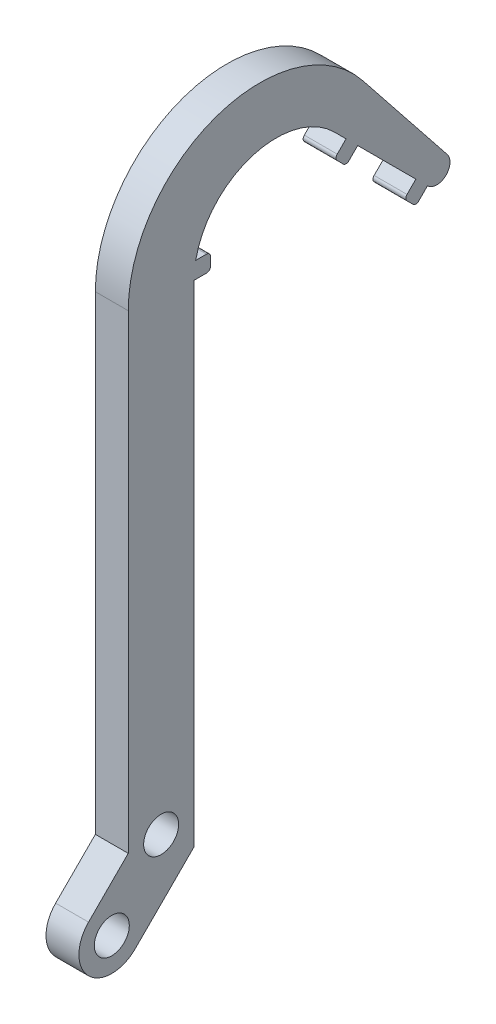
ISO-10303-21;
HEADER;
FILE_DESCRIPTION(('STEP AP214'),'2;1');
FILE_NAME('part.step','',(''),(''),'','','');
FILE_SCHEMA(('AUTOMOTIVE_DESIGN { 1 0 10303 214 1 1 1 1 }'));
ENDSEC;
DATA;
#1=APPLICATION_CONTEXT('core data for automotive mechanical design processes');
#2=APPLICATION_PROTOCOL_DEFINITION('international standard','automotive_design',2000,#1);
#3=PRODUCT_CONTEXT('',#1,'mechanical');
#4=PRODUCT('Part','Part','',(#3));
#5=PRODUCT_RELATED_PRODUCT_CATEGORY('part','',(#4));
#6=PRODUCT_DEFINITION_FORMATION('','',#4);
#7=PRODUCT_DEFINITION_CONTEXT('part definition',#1,'design');
#8=PRODUCT_DEFINITION('design','',#6,#7);
#9=PRODUCT_DEFINITION_SHAPE('','',#8);
#10=(LENGTH_UNIT() NAMED_UNIT(*) SI_UNIT(.MILLI.,.METRE.));
#11=(NAMED_UNIT(*) PLANE_ANGLE_UNIT() SI_UNIT($,.RADIAN.));
#12=(NAMED_UNIT(*) SI_UNIT($,.STERADIAN.) SOLID_ANGLE_UNIT());
#13=UNCERTAINTY_MEASURE_WITH_UNIT(LENGTH_MEASURE(1.E-05),#10,'distance_accuracy_value','');
#14=(GEOMETRIC_REPRESENTATION_CONTEXT(3) GLOBAL_UNCERTAINTY_ASSIGNED_CONTEXT((#13)) GLOBAL_UNIT_ASSIGNED_CONTEXT((#10,
#11,#12)) REPRESENTATION_CONTEXT('',''));
#15=CARTESIAN_POINT('',(0.,0.,0.));
#16=DIRECTION('',(0.,0.,1.));
#17=DIRECTION('',(1.,0.,0.));
#18=AXIS2_PLACEMENT_3D('',#15,#16,#17);
#19=CARTESIAN_POINT('',(6.35,-6.73519209080201,-29.1858323934747));
#20=DIRECTION('',(0.,0.707106781186544,-0.707106781186551));
#21=DIRECTION('',(0.,0.707106781186551,0.707106781186544));
#22=AXIS2_PLACEMENT_3D('',#19,#20,#21);
#23=PLANE('',#22);
#24=DIRECTION('',(0.,-0.707106781186551,-0.707106781186544));
#25=VECTOR('',#24,1.);
#26=CARTESIAN_POINT('',(6.35,-6.73519209080201,-29.1858323934747));
#27=LINE('',#26,#25);
#28=CARTESIAN_POINT('',(6.35,6.73519209080179,-15.715448211871));
#29=VERTEX_POINT('',#28);
#30=CARTESIAN_POINT('',(6.35,-4.49012806053471,-26.9407683632074));
#31=VERTEX_POINT('',#30);
#32=EDGE_CURVE('E312',#29,#31,#27,.T.);
#33=ORIENTED_EDGE('',*,*,#32,.F.);
#34=DIRECTION('',(1.,0.,0.));
#35=VECTOR('',#34,1.);
#36=CARTESIAN_POINT('',(-6.34999999999994,6.7351920908018,-15.715448211871));
#37=LINE('',#36,#35);
#38=CARTESIAN_POINT('',(0.,6.7351920908018,-15.715448211871));
#39=VERTEX_POINT('',#38);
#40=EDGE_CURVE('E254',#39,#29,#37,.T.);
#41=ORIENTED_EDGE('',*,*,#40,.F.);
#42=DIRECTION('',(0.,-0.707106781186551,-0.707106781186544));
#43=VECTOR('',#42,1.);
#44=CARTESIAN_POINT('',(0.,-6.73519209080201,-29.1858323934747));
#45=LINE('',#44,#43);
#46=CARTESIAN_POINT('',(0.,-4.49012806053471,-26.9407683632074));
#47=VERTEX_POINT('',#46);
#48=EDGE_CURVE('E222',#39,#47,#45,.T.);
#49=ORIENTED_EDGE('',*,*,#48,.T.);
#50=DIRECTION('',(1.,0.,0.));
#51=VECTOR('',#50,1.);
#52=CARTESIAN_POINT('',(-6.34999999999994,-4.49012806053463,-26.9407683632075));
#53=LINE('',#52,#51);
#54=EDGE_CURVE('E275',#47,#31,#53,.T.);
#55=ORIENTED_EDGE('',*,*,#54,.T.);
#56=EDGE_LOOP('',(#33,#41,#49,#55));
#57=FACE_BOUND('',#56,.T.);
#58=ADVANCED_FACE('F36',(#57),#23,.F.);
#59=CARTESIAN_POINT('',(6.35,-97.1098719394654,36.2401280605346));
#60=DIRECTION('',(0.,-0.707106781186547,-0.707106781186548));
#61=DIRECTION('',(0.,0.707106781186548,-0.707106781186547));
#62=AXIS2_PLACEMENT_3D('',#59,#60,#61);
#63=PLANE('',#62);
#64=DIRECTION('',(0.,-0.707106781186548,0.707106781186547));
#65=VECTOR('',#64,1.);
#66=CARTESIAN_POINT('',(0.,-97.1098719394654,36.2401280605346));
#67=LINE('',#66,#65);
#68=CARTESIAN_POINT('',(0.,-89.4447438789309,28.575));
#69=VERTEX_POINT('',#68);
#70=CARTESIAN_POINT('',(0.,-97.1098719394654,36.2401280605346));
#71=VERTEX_POINT('',#70);
#72=EDGE_CURVE('E300',#69,#71,#67,.T.);
#73=ORIENTED_EDGE('',*,*,#72,.T.);
#74=DIRECTION('',(-1.,0.,0.));
#75=VECTOR('',#74,1.);
#76=CARTESIAN_POINT('',(6.35,-97.1098719394654,36.2401280605346));
#77=LINE('',#76,#75);
#78=CARTESIAN_POINT('',(6.35,-97.1098719394654,36.2401280605346));
#79=VERTEX_POINT('',#78);
#80=EDGE_CURVE('E366',#79,#71,#77,.T.);
#81=ORIENTED_EDGE('',*,*,#80,.F.);
#82=DIRECTION('',(0.,-0.707106781186548,0.707106781186547));
#83=VECTOR('',#82,1.);
#84=CARTESIAN_POINT('',(6.35,-97.1098719394654,36.2401280605346));
#85=LINE('',#84,#83);
#86=CARTESIAN_POINT('',(6.35,-89.4447438789309,28.575));
#87=VERTEX_POINT('',#86);
#88=EDGE_CURVE('E301',#87,#79,#85,.T.);
#89=ORIENTED_EDGE('',*,*,#88,.F.);
#90=DIRECTION('',(-1.,0.,0.));
#91=VECTOR('',#90,1.);
#92=CARTESIAN_POINT('',(6.35,-89.4447438789309,28.575));
#93=LINE('',#92,#91);
#94=EDGE_CURVE('E324',#87,#69,#93,.T.);
#95=ORIENTED_EDGE('',*,*,#94,.T.);
#96=EDGE_LOOP('',(#73,#81,#89,#95));
#97=FACE_BOUND('',#96,.T.);
#98=ADVANCED_FACE('F450',(#97),#63,.F.);
#99=CARTESIAN_POINT('',(6.35,-101.6,31.75));
#100=DIRECTION('',(-1.,0.,0.));
#101=DIRECTION('',(0.,0.,1.));
#102=AXIS2_PLACEMENT_3D('',#99,#100,#101);
#103=CYLINDRICAL_SURFACE('',#102,6.34999999999997);
#104=CARTESIAN_POINT('',(0.,-101.6,31.75));
#105=DIRECTION('',(1.,0.,0.));
#106=DIRECTION('',(0.,0.,-1.));
#107=AXIS2_PLACEMENT_3D('',#104,#105,#106);
#108=CIRCLE('',#107,6.34999999999997);
#109=CARTESIAN_POINT('',(0.,-106.090128060535,27.2598719394654));
#110=VERTEX_POINT('',#109);
#111=EDGE_CURVE('E327',#71,#110,#108,.T.);
#112=ORIENTED_EDGE('',*,*,#111,.T.);
#113=DIRECTION('',(-1.,0.,0.));
#114=VECTOR('',#113,1.);
#115=CARTESIAN_POINT('',(6.35,-106.090128060535,27.2598719394654));
#116=LINE('',#115,#114);
#117=CARTESIAN_POINT('',(6.35,-106.090128060535,27.2598719394654));
#118=VERTEX_POINT('',#117);
#119=EDGE_CURVE('E363',#118,#110,#116,.T.);
#120=ORIENTED_EDGE('',*,*,#119,.F.);
#121=CARTESIAN_POINT('',(6.35,-101.6,31.75));
#122=DIRECTION('',(1.,0.,0.));
#123=DIRECTION('',(0.,0.,-1.));
#124=AXIS2_PLACEMENT_3D('',#121,#122,#123);
#125=CIRCLE('',#124,6.34999999999997);
#126=EDGE_CURVE('E304',#79,#118,#125,.T.);
#127=ORIENTED_EDGE('',*,*,#126,.F.);
#128=ORIENTED_EDGE('',*,*,#80,.T.);
#129=EDGE_LOOP('',(#112,#120,#127,#128));
#130=FACE_BOUND('',#129,.T.);
#131=ADVANCED_FACE('F446',(#130),#103,.T.);
#132=CARTESIAN_POINT('',(6.35,-94.7052561210691,15.875));
#133=DIRECTION('',(0.,0.707106781186549,0.707106781186546));
#134=DIRECTION('',(0.,-0.707106781186546,0.707106781186549));
#135=AXIS2_PLACEMENT_3D('',#132,#133,#134);
#136=PLANE('',#135);
#137=DIRECTION('',(0.,0.707106781186546,-0.707106781186549));
#138=VECTOR('',#137,1.);
#139=CARTESIAN_POINT('',(0.,-94.7052561210691,15.875));
#140=LINE('',#139,#138);
#141=CARTESIAN_POINT('',(0.,-94.7052561210691,15.875));
#142=VERTEX_POINT('',#141);
#143=EDGE_CURVE('E329',#110,#142,#140,.T.);
#144=ORIENTED_EDGE('',*,*,#143,.T.);
#145=DIRECTION('',(-1.,0.,0.));
#146=VECTOR('',#145,1.);
#147=CARTESIAN_POINT('',(6.35,-94.7052561210691,15.875));
#148=LINE('',#147,#146);
#149=CARTESIAN_POINT('',(6.35,-94.7052561210691,15.875));
#150=VERTEX_POINT('',#149);
#151=EDGE_CURVE('E360',#150,#142,#148,.T.);
#152=ORIENTED_EDGE('',*,*,#151,.F.);
#153=DIRECTION('',(0.,0.707106781186546,-0.707106781186549));
#154=VECTOR('',#153,1.);
#155=CARTESIAN_POINT('',(6.35,-94.7052561210691,15.875));
#156=LINE('',#155,#154);
#157=EDGE_CURVE('E307',#118,#150,#156,.T.);
#158=ORIENTED_EDGE('',*,*,#157,.F.);
#159=ORIENTED_EDGE('',*,*,#119,.T.);
#160=EDGE_LOOP('',(#144,#152,#158,#159));
#161=FACE_BOUND('',#160,.T.);
#162=ADVANCED_FACE('F443',(#161),#136,.F.);
#163=CARTESIAN_POINT('',(6.35,0.,15.875));
#164=DIRECTION('',(0.,0.,1.));
#165=DIRECTION('',(0.,-1.,0.));
#166=AXIS2_PLACEMENT_3D('',#163,#164,#165);
#167=PLANE('',#166);
#168=DIRECTION('',(0.,1.,0.));
#169=VECTOR('',#168,1.);
#170=CARTESIAN_POINT('',(0.,0.,15.875));
#171=LINE('',#170,#169);
#172=CARTESIAN_POINT('',(0.,0.,15.875));
#173=VERTEX_POINT('',#172);
#174=EDGE_CURVE('E223',#142,#173,#171,.T.);
#175=ORIENTED_EDGE('',*,*,#174,.T.);
#176=DIRECTION('',(-1.,0.,0.));
#177=VECTOR('',#176,1.);
#178=CARTESIAN_POINT('',(6.35,0.,15.875));
#179=LINE('',#178,#177);
#180=CARTESIAN_POINT('',(6.35,0.,15.875));
#181=VERTEX_POINT('',#180);
#182=EDGE_CURVE('E357',#181,#173,#179,.T.);
#183=ORIENTED_EDGE('',*,*,#182,.F.);
#184=DIRECTION('',(0.,1.,0.));
#185=VECTOR('',#184,1.);
#186=CARTESIAN_POINT('',(6.35,0.,15.875));
#187=LINE('',#186,#185);
#188=EDGE_CURVE('E309',#150,#181,#187,.T.);
#189=ORIENTED_EDGE('',*,*,#188,.F.);
#190=ORIENTED_EDGE('',*,*,#151,.T.);
#191=EDGE_LOOP('',(#175,#183,#189,#190));
#192=FACE_BOUND('',#191,.T.);
#193=ADVANCED_FACE('F438',(#192),#167,.F.);
#194=CARTESIAN_POINT('',(6.35,0.,0.));
#195=DIRECTION('',(-1.,0.,0.));
#196=DIRECTION('',(0.,0.,1.));
#197=AXIS2_PLACEMENT_3D('',#194,#195,#196);
#198=CYLINDRICAL_SURFACE('',#197,15.875);
#199=CARTESIAN_POINT('',(6.35,0.,0.));
#200=DIRECTION('',(-1.,0.,0.));
#201=DIRECTION('',(0.,0.,-1.));
#202=AXIS2_PLACEMENT_3D('',#199,#200,#201);
#203=CIRCLE('',#202,15.875);
#204=CARTESIAN_POINT('',(6.35,3.17499999999989,15.5542598666732));
#205=VERTEX_POINT('',#204);
#206=CARTESIAN_POINT('',(6.35,11.2253201513364,-11.2253201513365));
#207=VERTEX_POINT('',#206);
#208=EDGE_CURVE('E229',#205,#207,#203,.T.);
#209=ORIENTED_EDGE('',*,*,#208,.F.);
#210=DIRECTION('',(-1.,0.,0.));
#211=VECTOR('',#210,1.);
#212=CARTESIAN_POINT('',(6.35,3.17499999999989,15.5542598666732));
#213=LINE('',#212,#211);
#214=CARTESIAN_POINT('',(0.,3.17499999999989,15.5542598666732));
#215=VERTEX_POINT('',#214);
#216=EDGE_CURVE('E227',#205,#215,#213,.T.);
#217=ORIENTED_EDGE('',*,*,#216,.T.);
#218=CARTESIAN_POINT('',(0.,0.,0.));
#219=DIRECTION('',(-1.,0.,0.));
#220=DIRECTION('',(0.,0.,-1.));
#221=AXIS2_PLACEMENT_3D('',#218,#219,#220);
#222=CIRCLE('',#221,15.875);
#223=CARTESIAN_POINT('',(0.,11.2253201513364,-11.2253201513365));
#224=VERTEX_POINT('',#223);
#225=EDGE_CURVE('E209',#215,#224,#222,.T.);
#226=ORIENTED_EDGE('',*,*,#225,.T.);
#227=DIRECTION('',(-1.,0.,0.));
#228=VECTOR('',#227,1.);
#229=CARTESIAN_POINT('',(6.35,11.2253201513364,-11.2253201513365));
#230=LINE('',#229,#228);
#231=EDGE_CURVE('E355',#207,#224,#230,.T.);
#232=ORIENTED_EDGE('',*,*,#231,.F.);
#233=EDGE_LOOP('',(#209,#217,#226,#232));
#234=FACE_BOUND('',#233,.T.);
#235=ADVANCED_FACE('F228',(#234),#198,.F.);
#236=CARTESIAN_POINT('',(0.,8.98025612106909,-13.4703841816038));
#237=VERTEX_POINT('',#236);
#238=EDGE_CURVE('E218',#224,#237,#45,.T.);
#239=ORIENTED_EDGE('',*,*,#238,.T.);
#240=DIRECTION('',(1.,0.,0.));
#241=VECTOR('',#240,1.);
#242=CARTESIAN_POINT('',(-6.34999999999994,8.98025612106917,-13.4703841816038));
#243=LINE('',#242,#241);
#244=CARTESIAN_POINT('',(6.35,8.98025612106909,-13.4703841816038));
#245=VERTEX_POINT('',#244);
#246=EDGE_CURVE('E265',#237,#245,#243,.T.);
#247=ORIENTED_EDGE('',*,*,#246,.T.);
#248=EDGE_CURVE('E313',#207,#245,#27,.T.);
#249=ORIENTED_EDGE('',*,*,#248,.F.);
#250=ORIENTED_EDGE('',*,*,#231,.T.);
#251=EDGE_LOOP('',(#239,#247,#249,#250));
#252=FACE_BOUND('',#251,.T.);
#253=ADVANCED_FACE('F515',(#252),#23,.F.);
#254=CARTESIAN_POINT('',(6.35,-4.93914086658819,-30.9818836176886));
#255=DIRECTION('',(-1.,0.,0.));
#256=DIRECTION('',(0.,0.,1.));
#257=AXIS2_PLACEMENT_3D('',#254,#255,#256);
#258=CYLINDRICAL_SURFACE('',#257,2.54);
#259=CARTESIAN_POINT('',(0.,-4.93914086658819,-30.9818836176886));
#260=DIRECTION('',(1.,0.,0.));
#261=DIRECTION('',(0.,0.,-1.));
#262=AXIS2_PLACEMENT_3D('',#259,#260,#261);
#263=CIRCLE('',#262,2.54);
#264=CARTESIAN_POINT('',(0.,-6.73519209080201,-29.1858323934747));
#265=VERTEX_POINT('',#264);
#266=CARTESIAN_POINT('',(0.,-3.35748391332531,-32.969334568579));
#267=VERTEX_POINT('',#266);
#268=EDGE_CURVE('E334',#265,#267,#263,.T.);
#269=ORIENTED_EDGE('',*,*,#268,.T.);
#270=DIRECTION('',(-1.,0.,0.));
#271=VECTOR('',#270,1.);
#272=CARTESIAN_POINT('',(6.35,-3.35748391332531,-32.969334568579));
#273=LINE('',#272,#271);
#274=CARTESIAN_POINT('',(6.35,-3.35748391332531,-32.969334568579));
#275=VERTEX_POINT('',#274);
#276=EDGE_CURVE('E349',#275,#267,#273,.T.);
#277=ORIENTED_EDGE('',*,*,#276,.F.);
#278=CARTESIAN_POINT('',(6.35,-4.93914086658819,-30.9818836176886));
#279=DIRECTION('',(1.,0.,0.));
#280=DIRECTION('',(0.,0.,-1.));
#281=AXIS2_PLACEMENT_3D('',#278,#279,#280);
#282=CIRCLE('',#281,2.54);
#283=CARTESIAN_POINT('',(6.35,-6.73519209080201,-29.1858323934747));
#284=VERTEX_POINT('',#283);
#285=EDGE_CURVE('E316',#284,#275,#282,.T.);
#286=ORIENTED_EDGE('',*,*,#285,.F.);
#287=DIRECTION('',(-1.,0.,0.));
#288=VECTOR('',#287,1.);
#289=CARTESIAN_POINT('',(6.35,-6.73519209080201,-29.1858323934747));
#290=LINE('',#289,#288);
#291=EDGE_CURVE('E352',#284,#265,#290,.T.);
#292=ORIENTED_EDGE('',*,*,#291,.T.);
#293=EDGE_LOOP('',(#269,#277,#286,#292));
#294=FACE_BOUND('',#293,.T.);
#295=ADVANCED_FACE('F472',(#294),#258,.T.);
#296=CARTESIAN_POINT('',(6.35,17.0865695326289,-16.699509508904));
#297=DIRECTION('',(0.,-0.622699587898773,0.782461004287561));
#298=DIRECTION('',(0.,-0.782461004287561,-0.622699587898773));
#299=AXIS2_PLACEMENT_3D('',#296,#297,#298);
#300=PLANE('',#299);
#301=DIRECTION('',(0.,0.78246100428756,0.622699587898773));
#302=VECTOR('',#301,1.);
#303=CARTESIAN_POINT('',(0.,17.0865695326289,-16.699509508904));
#304=LINE('',#303,#302);
#305=CARTESIAN_POINT('',(0.,17.0865695326289,-16.699509508904));
#306=VERTEX_POINT('',#305);
#307=EDGE_CURVE('E336',#267,#306,#304,.T.);
#308=ORIENTED_EDGE('',*,*,#307,.T.);
#309=DIRECTION('',(-1.,0.,0.));
#310=VECTOR('',#309,1.);
#311=CARTESIAN_POINT('',(6.35,17.0865695326289,-16.699509508904));
#312=LINE('',#311,#310);
#313=CARTESIAN_POINT('',(6.35,17.0865695326289,-16.699509508904));
#314=VERTEX_POINT('',#313);
#315=EDGE_CURVE('E346',#314,#306,#312,.T.);
#316=ORIENTED_EDGE('',*,*,#315,.F.);
#317=DIRECTION('',(0.,0.78246100428756,0.622699587898773));
#318=VECTOR('',#317,1.);
#319=CARTESIAN_POINT('',(6.35,17.0865695326289,-16.699509508904));
#320=LINE('',#319,#318);
#321=EDGE_CURVE('E318',#275,#314,#320,.T.);
#322=ORIENTED_EDGE('',*,*,#321,.F.);
#323=ORIENTED_EDGE('',*,*,#276,.T.);
#324=EDGE_LOOP('',(#308,#316,#322,#323));
#325=FACE_BOUND('',#324,.T.);
#326=ADVANCED_FACE('F465',(#325),#300,.F.);
#327=CARTESIAN_POINT('',(6.35,1.27,3.175));
#328=DIRECTION('',(-1.,0.,0.));
#329=DIRECTION('',(0.,0.,1.));
#330=AXIS2_PLACEMENT_3D('',#327,#328,#329);
#331=CYLINDRICAL_SURFACE('',#330,25.4);
#332=CARTESIAN_POINT('',(0.,1.27,3.175));
#333=DIRECTION('',(1.,0.,0.));
#334=DIRECTION('',(0.,0.,-1.));
#335=AXIS2_PLACEMENT_3D('',#332,#333,#334);
#336=CIRCLE('',#335,25.4);
#337=CARTESIAN_POINT('',(0.,1.27,28.575));
#338=VERTEX_POINT('',#337);
#339=EDGE_CURVE('E338',#306,#338,#336,.T.);
#340=ORIENTED_EDGE('',*,*,#339,.T.);
#341=DIRECTION('',(-1.,0.,0.));
#342=VECTOR('',#341,1.);
#343=CARTESIAN_POINT('',(6.35,1.27,28.575));
#344=LINE('',#343,#342);
#345=CARTESIAN_POINT('',(6.35,1.27,28.575));
#346=VERTEX_POINT('',#345);
#347=EDGE_CURVE('E343',#346,#338,#344,.T.);
#348=ORIENTED_EDGE('',*,*,#347,.F.);
#349=CARTESIAN_POINT('',(6.35,1.27,3.175));
#350=DIRECTION('',(1.,0.,0.));
#351=DIRECTION('',(0.,0.,-1.));
#352=AXIS2_PLACEMENT_3D('',#349,#350,#351);
#353=CIRCLE('',#352,25.4);
#354=EDGE_CURVE('E320',#314,#346,#353,.T.);
#355=ORIENTED_EDGE('',*,*,#354,.F.);
#356=ORIENTED_EDGE('',*,*,#315,.T.);
#357=EDGE_LOOP('',(#340,#348,#355,#356));
#358=FACE_BOUND('',#357,.T.);
#359=ADVANCED_FACE('F461',(#358),#331,.T.);
#360=CARTESIAN_POINT('',(6.35,-89.4447438789309,28.575));
#361=DIRECTION('',(0.,0.,-1.));
#362=DIRECTION('',(0.,1.,0.));
#363=AXIS2_PLACEMENT_3D('',#360,#361,#362);
#364=PLANE('',#363);
#365=DIRECTION('',(0.,-1.,0.));
#366=VECTOR('',#365,1.);
#367=CARTESIAN_POINT('',(0.,-89.4447438789309,28.575));
#368=LINE('',#367,#366);
#369=EDGE_CURVE('E305',#338,#69,#368,.T.);
#370=ORIENTED_EDGE('',*,*,#369,.T.);
#371=ORIENTED_EDGE('',*,*,#94,.F.);
#372=DIRECTION('',(0.,-1.,0.));
#373=VECTOR('',#372,1.);
#374=CARTESIAN_POINT('',(6.35,-89.4447438789309,28.575));
#375=LINE('',#374,#373);
#376=EDGE_CURVE('E322',#346,#87,#375,.T.);
#377=ORIENTED_EDGE('',*,*,#376,.F.);
#378=ORIENTED_EDGE('',*,*,#347,.T.);
#379=EDGE_LOOP('',(#370,#371,#377,#378));
#380=FACE_BOUND('',#379,.T.);
#381=ADVANCED_FACE('F456',(#380),#364,.F.);
#382=CARTESIAN_POINT('',(6.35,1.27,3.175));
#383=DIRECTION('',(1.,0.,0.));
#384=DIRECTION('',(0.,0.,-1.));
#385=AXIS2_PLACEMENT_3D('',#382,#383,#384);
#386=PLANE('',#385);
#387=DIRECTION('',(0.,-0.707106781186547,-0.707106781186547));
#388=VECTOR('',#387,1.);
#389=CARTESIAN_POINT('',(6.35,-8.98025612106921,-26.9407683632075));
#390=LINE('',#389,#388);
#391=CARTESIAN_POINT('',(6.35,-7.27400745806607,-25.2345197002044));
#392=VERTEX_POINT('',#391);
#393=CARTESIAN_POINT('',(6.35,-8.44144075380506,-26.4019529959434));
#394=VERTEX_POINT('',#393);
#395=EDGE_CURVE('E280',#392,#394,#390,.T.);
#396=ORIENTED_EDGE('',*,*,#395,.T.);
#397=CARTESIAN_POINT('',(6.35,-7.90262538654091,-26.9407683632075));
#398=DIRECTION('',(1.,0.,0.));
#399=DIRECTION('',(0.,0.,-1.));
#400=AXIS2_PLACEMENT_3D('',#397,#398,#399);
#401=CIRCLE('',#400,0.762);
#402=CARTESIAN_POINT('',(6.35,-8.44144075380506,-27.4795837304717));
#403=VERTEX_POINT('',#402);
#404=EDGE_CURVE('E384',#394,#403,#401,.T.);
#405=ORIENTED_EDGE('',*,*,#404,.T.);
#406=DIRECTION('',(0.,0.707106781186548,-0.707106781186548));
#407=VECTOR('',#406,1.);
#408=CARTESIAN_POINT('',(6.35,-6.73519209080201,-29.1858323934747));
#409=LINE('',#408,#407);
#410=EDGE_CURVE('E283',#403,#284,#409,.T.);
#411=ORIENTED_EDGE('',*,*,#410,.T.);
#412=ORIENTED_EDGE('',*,*,#285,.T.);
#413=ORIENTED_EDGE('',*,*,#321,.T.);
#414=ORIENTED_EDGE('',*,*,#354,.T.);
#415=ORIENTED_EDGE('',*,*,#376,.T.);
#416=ORIENTED_EDGE('',*,*,#88,.T.);
#417=ORIENTED_EDGE('',*,*,#126,.T.);
#418=ORIENTED_EDGE('',*,*,#157,.T.);
#419=ORIENTED_EDGE('',*,*,#188,.T.);
#420=DIRECTION('',(0.,0.,-1.));
#421=VECTOR('',#420,1.);
#422=CARTESIAN_POINT('',(6.35,-1.10805462028019E-13,15.875));
#423=LINE('',#422,#421);
#424=CARTESIAN_POINT('',(6.35,-1.10805462028019E-13,13.462));
#425=VERTEX_POINT('',#424);
#426=EDGE_CURVE('E244',#181,#425,#423,.T.);
#427=ORIENTED_EDGE('',*,*,#426,.T.);
#428=CARTESIAN_POINT('',(6.35,0.761999999999889,13.462));
#429=DIRECTION('',(1.,0.,0.));
#430=DIRECTION('',(0.,0.,-1.));
#431=AXIS2_PLACEMENT_3D('',#428,#429,#430);
#432=CIRCLE('',#431,0.762);
#433=CARTESIAN_POINT('',(6.35,0.761999999999889,12.7));
#434=VERTEX_POINT('',#433);
#435=EDGE_CURVE('E376',#425,#434,#432,.T.);
#436=ORIENTED_EDGE('',*,*,#435,.T.);
#437=DIRECTION('',(0.,1.,0.));
#438=VECTOR('',#437,1.);
#439=CARTESIAN_POINT('',(6.35,-1.10805462028019E-13,12.7));
#440=LINE('',#439,#438);
#441=CARTESIAN_POINT('',(6.35,2.41299999999989,12.7));
#442=VERTEX_POINT('',#441);
#443=EDGE_CURVE('E247',#434,#442,#440,.T.);
#444=ORIENTED_EDGE('',*,*,#443,.T.);
#445=CARTESIAN_POINT('',(6.35,2.41299999999989,13.462));
#446=DIRECTION('',(1.,0.,0.));
#447=DIRECTION('',(0.,0.,-1.));
#448=AXIS2_PLACEMENT_3D('',#445,#446,#447);
#449=CIRCLE('',#448,0.762);
#450=CARTESIAN_POINT('',(6.35,3.17499999999989,13.462));
#451=VERTEX_POINT('',#450);
#452=EDGE_CURVE('E374',#442,#451,#449,.T.);
#453=ORIENTED_EDGE('',*,*,#452,.T.);
#454=DIRECTION('',(0.,0.,1.));
#455=VECTOR('',#454,1.);
#456=CARTESIAN_POINT('',(6.35,3.17499999999989,15.875));
#457=LINE('',#456,#455);
#458=EDGE_CURVE('E241',#451,#205,#457,.T.);
#459=ORIENTED_EDGE('',*,*,#458,.T.);
#460=ORIENTED_EDGE('',*,*,#208,.T.);
#461=ORIENTED_EDGE('',*,*,#248,.T.);
#462=DIRECTION('',(0.,-0.707106781186548,0.707106781186547));
#463=VECTOR('',#462,1.);
#464=CARTESIAN_POINT('',(6.35,6.73519209080188,-11.2253201513366));
#465=LINE('',#464,#463);
#466=CARTESIAN_POINT('',(6.35,7.27400745806603,-11.7641355186007));
#467=VERTEX_POINT('',#466);
#468=EDGE_CURVE('E232',#245,#467,#465,.T.);
#469=ORIENTED_EDGE('',*,*,#468,.T.);
#470=CARTESIAN_POINT('',(6.35,6.73519209080188,-12.3029508858649));
#471=DIRECTION('',(1.,0.,0.));
#472=DIRECTION('',(0.,0.,-1.));
#473=AXIS2_PLACEMENT_3D('',#470,#471,#472);
#474=CIRCLE('',#473,0.762);
#475=CARTESIAN_POINT('',(6.35,6.19637672353773,-11.7641355186007));
#476=VERTEX_POINT('',#475);
#477=EDGE_CURVE('E380',#467,#476,#474,.T.);
#478=ORIENTED_EDGE('',*,*,#477,.T.);
#479=DIRECTION('',(0.,-0.707106781186547,-0.707106781186547));
#480=VECTOR('',#479,1.);
#481=CARTESIAN_POINT('',(6.35,4.49012806053459,-13.4703841816038));
#482=LINE('',#481,#480);
#483=CARTESIAN_POINT('',(6.35,5.02894342779874,-12.9315688143397));
#484=VERTEX_POINT('',#483);
#485=EDGE_CURVE('E260',#476,#484,#482,.T.);
#486=ORIENTED_EDGE('',*,*,#485,.T.);
#487=CARTESIAN_POINT('',(6.35,5.56775879506289,-13.4703841816038));
#488=DIRECTION('',(1.,0.,0.));
#489=DIRECTION('',(0.,0.,-1.));
#490=AXIS2_PLACEMENT_3D('',#487,#488,#489);
#491=CIRCLE('',#490,0.762);
#492=CARTESIAN_POINT('',(6.35,5.02894342779874,-14.009199548868));
#493=VERTEX_POINT('',#492);
#494=EDGE_CURVE('E378',#484,#493,#491,.T.);
#495=ORIENTED_EDGE('',*,*,#494,.T.);
#496=DIRECTION('',(0.,0.707106781186548,-0.707106781186548));
#497=VECTOR('',#496,1.);
#498=CARTESIAN_POINT('',(6.35,6.7351920908018,-15.715448211871));
#499=LINE('',#498,#497);
#500=EDGE_CURVE('E263',#493,#29,#499,.T.);
#501=ORIENTED_EDGE('',*,*,#500,.T.);
#502=ORIENTED_EDGE('',*,*,#32,.T.);
#503=DIRECTION('',(0.,-0.707106781186548,0.707106781186547));
#504=VECTOR('',#503,1.);
#505=CARTESIAN_POINT('',(6.35,-6.73519209080192,-24.6957043329402));
#506=LINE('',#505,#504);
#507=CARTESIAN_POINT('',(6.35,-6.19637672353777,-25.2345197002044));
#508=VERTEX_POINT('',#507);
#509=EDGE_CURVE('E270',#31,#508,#506,.T.);
#510=ORIENTED_EDGE('',*,*,#509,.T.);
#511=CARTESIAN_POINT('',(6.35,-6.73519209080192,-25.7733350674685));
#512=DIRECTION('',(1.,0.,0.));
#513=DIRECTION('',(0.,0.,-1.));
#514=AXIS2_PLACEMENT_3D('',#511,#512,#513);
#515=CIRCLE('',#514,0.762);
#516=EDGE_CURVE('E382',#508,#392,#515,.T.);
#517=ORIENTED_EDGE('',*,*,#516,.T.);
#518=EDGE_LOOP('',(#396,#405,#411,#412,#413,#414,#415,#416,#417,#418,#419,#427,#436,#444,#453,
#459,#460,#461,#469,#478,#486,#495,#501,#502,#510,#517));
#519=FACE_BOUND('',#518,.T.);
#520=CARTESIAN_POINT('',(6.35,-89.4447438789309,22.225));
#521=DIRECTION('',(1.,0.,0.));
#522=DIRECTION('',(0.,0.,-1.));
#523=AXIS2_PLACEMENT_3D('',#520,#521,#522);
#524=CIRCLE('',#523,3.37819999999998);
#525=CARTESIAN_POINT('',(6.35,-89.4447438789309,18.8468));
#526=VERTEX_POINT('',#525);
#527=EDGE_CURVE('E288',#526,#526,#524,.T.);
#528=ORIENTED_EDGE('',*,*,#527,.F.);
#529=EDGE_LOOP('',(#528));
#530=FACE_BOUND('',#529,.T.);
#531=CARTESIAN_POINT('',(6.35,-101.6,31.75));
#532=DIRECTION('',(1.,0.,0.));
#533=DIRECTION('',(0.,0.,-1.));
#534=AXIS2_PLACEMENT_3D('',#531,#532,#533);
#535=CIRCLE('',#534,3.37819999999998);
#536=CARTESIAN_POINT('',(6.35,-101.6,28.3718));
#537=VERTEX_POINT('',#536);
#538=EDGE_CURVE('E294',#537,#537,#535,.T.);
#539=ORIENTED_EDGE('',*,*,#538,.F.);
#540=EDGE_LOOP('',(#539));
#541=FACE_BOUND('',#540,.T.);
#542=ADVANCED_FACE('F431',(#519,#530,#541),#386,.T.);
#543=CARTESIAN_POINT('',(0.,1.27,3.175));
#544=DIRECTION('',(1.,0.,0.));
#545=DIRECTION('',(0.,0.,-1.));
#546=AXIS2_PLACEMENT_3D('',#543,#544,#545);
#547=PLANE('',#546);
#548=DIRECTION('',(0.,-0.707106781186548,0.707106781186548));
#549=VECTOR('',#548,1.);
#550=CARTESIAN_POINT('',(0.,-6.73519209080201,-29.1858323934747));
#551=LINE('',#550,#549);
#552=CARTESIAN_POINT('',(0.,-8.44144075380506,-27.4795837304717));
#553=VERTEX_POINT('',#552);
#554=EDGE_CURVE('E274',#265,#553,#551,.T.);
#555=ORIENTED_EDGE('',*,*,#554,.T.);
#556=CARTESIAN_POINT('',(0.,-7.90262538654091,-26.9407683632075));
#557=DIRECTION('',(1.,0.,0.));
#558=DIRECTION('',(0.,0.,-1.));
#559=AXIS2_PLACEMENT_3D('',#556,#557,#558);
#560=CIRCLE('',#559,0.762);
#561=CARTESIAN_POINT('',(0.,-8.44144075380506,-26.4019529959434));
#562=VERTEX_POINT('',#561);
#563=EDGE_CURVE('E397',#553,#562,#560,.F.);
#564=ORIENTED_EDGE('',*,*,#563,.T.);
#565=DIRECTION('',(0.,0.707106781186548,0.707106781186548));
#566=VECTOR('',#565,1.);
#567=CARTESIAN_POINT('',(0.,-8.98025612106921,-26.9407683632075));
#568=LINE('',#567,#566);
#569=CARTESIAN_POINT('',(0.,-7.27400745806607,-25.2345197002044));
#570=VERTEX_POINT('',#569);
#571=EDGE_CURVE('E271',#562,#570,#568,.T.);
#572=ORIENTED_EDGE('',*,*,#571,.T.);
#573=CARTESIAN_POINT('',(0.,-6.73519209080192,-25.7733350674685));
#574=DIRECTION('',(1.,0.,0.));
#575=DIRECTION('',(0.,0.,-1.));
#576=AXIS2_PLACEMENT_3D('',#573,#574,#575);
#577=CIRCLE('',#576,0.762);
#578=CARTESIAN_POINT('',(0.,-6.19637672353777,-25.2345197002044));
#579=VERTEX_POINT('',#578);
#580=EDGE_CURVE('E395',#570,#579,#577,.F.);
#581=ORIENTED_EDGE('',*,*,#580,.T.);
#582=DIRECTION('',(0.,0.707106781186548,-0.707106781186547));
#583=VECTOR('',#582,1.);
#584=CARTESIAN_POINT('',(0.,-6.73519209080192,-24.6957043329402));
#585=LINE('',#584,#583);
#586=EDGE_CURVE('E277',#579,#47,#585,.T.);
#587=ORIENTED_EDGE('',*,*,#586,.T.);
#588=ORIENTED_EDGE('',*,*,#48,.F.);
#589=DIRECTION('',(0.,-0.707106781186548,0.707106781186548));
#590=VECTOR('',#589,1.);
#591=CARTESIAN_POINT('',(0.,6.7351920908018,-15.715448211871));
#592=LINE('',#591,#590);
#593=CARTESIAN_POINT('',(0.,5.02894342779874,-14.009199548868));
#594=VERTEX_POINT('',#593);
#595=EDGE_CURVE('E253',#39,#594,#592,.T.);
#596=ORIENTED_EDGE('',*,*,#595,.T.);
#597=CARTESIAN_POINT('',(0.,5.56775879506289,-13.4703841816038));
#598=DIRECTION('',(1.,0.,0.));
#599=DIRECTION('',(0.,0.,-1.));
#600=AXIS2_PLACEMENT_3D('',#597,#598,#599);
#601=CIRCLE('',#600,0.762);
#602=CARTESIAN_POINT('',(0.,5.02894342779874,-12.9315688143397));
#603=VERTEX_POINT('',#602);
#604=EDGE_CURVE('E392',#594,#603,#601,.F.);
#605=ORIENTED_EDGE('',*,*,#604,.T.);
#606=DIRECTION('',(0.,0.707106781186548,0.707106781186548));
#607=VECTOR('',#606,1.);
#608=CARTESIAN_POINT('',(0.,4.49012806053459,-13.4703841816038));
#609=LINE('',#608,#607);
#610=CARTESIAN_POINT('',(0.,6.19637672353773,-11.7641355186007));
#611=VERTEX_POINT('',#610);
#612=EDGE_CURVE('E251',#603,#611,#609,.T.);
#613=ORIENTED_EDGE('',*,*,#612,.T.);
#614=CARTESIAN_POINT('',(0.,6.73519209080188,-12.3029508858649));
#615=DIRECTION('',(1.,0.,0.));
#616=DIRECTION('',(0.,0.,-1.));
#617=AXIS2_PLACEMENT_3D('',#614,#615,#616);
#618=CIRCLE('',#617,0.762);
#619=CARTESIAN_POINT('',(0.,7.27400745806603,-11.7641355186007));
#620=VERTEX_POINT('',#619);
#621=EDGE_CURVE('E51',#611,#620,#618,.F.);
#622=ORIENTED_EDGE('',*,*,#621,.T.);
#623=DIRECTION('',(0.,0.707106781186548,-0.707106781186547));
#624=VECTOR('',#623,1.);
#625=CARTESIAN_POINT('',(0.,6.73519209080188,-11.2253201513366));
#626=LINE('',#625,#624);
#627=EDGE_CURVE('E257',#620,#237,#626,.T.);
#628=ORIENTED_EDGE('',*,*,#627,.T.);
#629=ORIENTED_EDGE('',*,*,#238,.F.);
#630=ORIENTED_EDGE('',*,*,#225,.F.);
#631=DIRECTION('',(0.,0.,-1.));
#632=VECTOR('',#631,1.);
#633=CARTESIAN_POINT('',(0.,3.17499999999989,15.875));
#634=LINE('',#633,#632);
#635=CARTESIAN_POINT('',(0.,3.17499999999989,13.462));
#636=VERTEX_POINT('',#635);
#637=EDGE_CURVE('E215',#215,#636,#634,.T.);
#638=ORIENTED_EDGE('',*,*,#637,.T.);
#639=CARTESIAN_POINT('',(0.,2.41299999999989,13.462));
#640=DIRECTION('',(1.,0.,0.));
#641=DIRECTION('',(0.,0.,-1.));
#642=AXIS2_PLACEMENT_3D('',#639,#640,#641);
#643=CIRCLE('',#642,0.762);
#644=CARTESIAN_POINT('',(0.,2.41299999999989,12.7));
#645=VERTEX_POINT('',#644);
#646=EDGE_CURVE('E388',#636,#645,#643,.F.);
#647=ORIENTED_EDGE('',*,*,#646,.T.);
#648=DIRECTION('',(0.,-1.,0.));
#649=VECTOR('',#648,1.);
#650=CARTESIAN_POINT('',(0.,-1.10805462028019E-13,12.7));
#651=LINE('',#650,#649);
#652=CARTESIAN_POINT('',(0.,0.761999999999889,12.7));
#653=VERTEX_POINT('',#652);
#654=EDGE_CURVE('E237',#645,#653,#651,.T.);
#655=ORIENTED_EDGE('',*,*,#654,.T.);
#656=CARTESIAN_POINT('',(0.,0.761999999999889,13.462));
#657=DIRECTION('',(1.,0.,0.));
#658=DIRECTION('',(0.,0.,-1.));
#659=AXIS2_PLACEMENT_3D('',#656,#657,#658);
#660=CIRCLE('',#659,0.762);
#661=CARTESIAN_POINT('',(0.,-1.10805462028019E-13,13.462));
#662=VERTEX_POINT('',#661);
#663=EDGE_CURVE('E390',#653,#662,#660,.F.);
#664=ORIENTED_EDGE('',*,*,#663,.T.);
#665=DIRECTION('',(0.,0.,1.));
#666=VECTOR('',#665,1.);
#667=CARTESIAN_POINT('',(0.,-1.10805462028019E-13,15.875));
#668=LINE('',#667,#666);
#669=EDGE_CURVE('E233',#662,#173,#668,.T.);
#670=ORIENTED_EDGE('',*,*,#669,.T.);
#671=ORIENTED_EDGE('',*,*,#174,.F.);
#672=ORIENTED_EDGE('',*,*,#143,.F.);
#673=ORIENTED_EDGE('',*,*,#111,.F.);
#674=ORIENTED_EDGE('',*,*,#72,.F.);
#675=ORIENTED_EDGE('',*,*,#369,.F.);
#676=ORIENTED_EDGE('',*,*,#339,.F.);
#677=ORIENTED_EDGE('',*,*,#307,.F.);
#678=ORIENTED_EDGE('',*,*,#268,.F.);
#679=EDGE_LOOP('',(#555,#564,#572,#581,#587,#588,#596,#605,#613,#622,#628,#629,#630,#638,#647,
#655,#664,#670,#671,#672,#673,#674,#675,#676,#677,#678));
#680=FACE_BOUND('',#679,.T.);
#681=CARTESIAN_POINT('',(0.,-89.4447438789309,22.225));
#682=DIRECTION('',(1.,0.,0.));
#683=DIRECTION('',(0.,0.,-1.));
#684=AXIS2_PLACEMENT_3D('',#681,#682,#683);
#685=CIRCLE('',#684,3.37819999999998);
#686=CARTESIAN_POINT('',(0.,-89.4447438789309,18.8468));
#687=VERTEX_POINT('',#686);
#688=EDGE_CURVE('E291',#687,#687,#685,.T.);
#689=ORIENTED_EDGE('',*,*,#688,.T.);
#690=EDGE_LOOP('',(#689));
#691=FACE_BOUND('',#690,.T.);
#692=CARTESIAN_POINT('',(0.,-101.6,31.75));
#693=DIRECTION('',(1.,0.,0.));
#694=DIRECTION('',(0.,0.,-1.));
#695=AXIS2_PLACEMENT_3D('',#692,#693,#694);
#696=CIRCLE('',#695,3.37819999999998);
#697=CARTESIAN_POINT('',(0.,-101.6,28.3718));
#698=VERTEX_POINT('',#697);
#699=EDGE_CURVE('E297',#698,#698,#696,.T.);
#700=ORIENTED_EDGE('',*,*,#699,.T.);
#701=EDGE_LOOP('',(#700));
#702=FACE_BOUND('',#701,.T.);
#703=ADVANCED_FACE('F212',(#680,#691,#702),#547,.F.);
#704=CARTESIAN_POINT('',(6.35,-101.6,31.75));
#705=DIRECTION('',(1.,0.,0.));
#706=DIRECTION('',(0.,0.,-1.));
#707=AXIS2_PLACEMENT_3D('',#704,#705,#706);
#708=CYLINDRICAL_SURFACE('',#707,3.37819999999998);
#709=ORIENTED_EDGE('',*,*,#538,.T.);
#710=EDGE_LOOP('',(#709));
#711=FACE_BOUND('',#710,.T.);
#712=ORIENTED_EDGE('',*,*,#699,.F.);
#713=EDGE_LOOP('',(#712));
#714=FACE_BOUND('',#713,.T.);
#715=ADVANCED_FACE('F613',(#711,#714),#708,.F.);
#716=CARTESIAN_POINT('',(6.35,-89.4447438789309,22.225));
#717=DIRECTION('',(1.,0.,0.));
#718=DIRECTION('',(0.,0.,-1.));
#719=AXIS2_PLACEMENT_3D('',#716,#717,#718);
#720=CYLINDRICAL_SURFACE('',#719,3.37819999999998);
#721=ORIENTED_EDGE('',*,*,#527,.T.);
#722=EDGE_LOOP('',(#721));
#723=FACE_BOUND('',#722,.T.);
#724=ORIENTED_EDGE('',*,*,#688,.F.);
#725=EDGE_LOOP('',(#724));
#726=FACE_BOUND('',#725,.T.);
#727=ADVANCED_FACE('F670',(#723,#726),#720,.F.);
#728=CARTESIAN_POINT('',(-6.34999999999994,-6.73519209080201,-29.1858323934747));
#729=DIRECTION('',(0.,-0.707106781186548,-0.707106781186548));
#730=DIRECTION('',(0.,0.707106781186548,-0.707106781186548));
#731=AXIS2_PLACEMENT_3D('',#728,#729,#730);
#732=PLANE('',#731);
#733=ORIENTED_EDGE('',*,*,#410,.F.);
#734=DIRECTION('',(1.,0.,0.));
#735=VECTOR('',#734,1.);
#736=CARTESIAN_POINT('',(-6.34999999999994,-8.44144075380506,-27.4795837304717));
#737=LINE('',#736,#735);
#738=EDGE_CURVE('E386',#403,#553,#737,.F.);
#739=ORIENTED_EDGE('',*,*,#738,.T.);
#740=ORIENTED_EDGE('',*,*,#554,.F.);
#741=ORIENTED_EDGE('',*,*,#291,.F.);
#742=EDGE_LOOP('',(#733,#739,#740,#741));
#743=FACE_BOUND('',#742,.T.);
#744=ADVANCED_FACE('F475',(#743),#732,.T.);
#745=CARTESIAN_POINT('',(-6.34999999999994,-8.98025612106921,-26.9407683632075));
#746=DIRECTION('',(0.,-0.707106781186548,0.707106781186548));
#747=DIRECTION('',(0.,-0.707106781186548,-0.707106781186548));
#748=AXIS2_PLACEMENT_3D('',#745,#746,#747);
#749=PLANE('',#748);
#750=ORIENTED_EDGE('',*,*,#571,.F.);
#751=DIRECTION('',(1.,0.,0.));
#752=VECTOR('',#751,1.);
#753=CARTESIAN_POINT('',(-6.34999999999994,-8.44144075380506,-26.4019529959434));
#754=LINE('',#753,#752);
#755=EDGE_CURVE('E371',#562,#394,#754,.T.);
#756=ORIENTED_EDGE('',*,*,#755,.T.);
#757=ORIENTED_EDGE('',*,*,#395,.F.);
#758=DIRECTION('',(1.,0.,0.));
#759=VECTOR('',#758,1.);
#760=CARTESIAN_POINT('',(-6.34999999999994,-7.27400745806607,-25.2345197002044));
#761=LINE('',#760,#759);
#762=EDGE_CURVE('E369',#392,#570,#761,.F.);
#763=ORIENTED_EDGE('',*,*,#762,.T.);
#764=EDGE_LOOP('',(#750,#756,#757,#763));
#765=FACE_BOUND('',#764,.T.);
#766=ADVANCED_FACE('F483',(#765),#749,.T.);
#767=CARTESIAN_POINT('',(-6.34999999999994,-6.73519209080192,-24.6957043329402));
#768=DIRECTION('',(0.,0.707106781186547,0.707106781186548));
#769=DIRECTION('',(0.,-0.707106781186548,0.707106781186547));
#770=AXIS2_PLACEMENT_3D('',#767,#768,#769);
#771=PLANE('',#770);
#772=ORIENTED_EDGE('',*,*,#586,.F.);
#773=DIRECTION('',(1.,0.,0.));
#774=VECTOR('',#773,1.);
#775=CARTESIAN_POINT('',(-6.34999999999994,-6.19637672353777,-25.2345197002044));
#776=LINE('',#775,#774);
#777=EDGE_CURVE('E399',#579,#508,#776,.T.);
#778=ORIENTED_EDGE('',*,*,#777,.T.);
#779=ORIENTED_EDGE('',*,*,#509,.F.);
#780=ORIENTED_EDGE('',*,*,#54,.F.);
#781=EDGE_LOOP('',(#772,#778,#779,#780));
#782=FACE_BOUND('',#781,.T.);
#783=ADVANCED_FACE('F493',(#782),#771,.T.);
#784=CARTESIAN_POINT('',(-6.34999999999994,6.7351920908018,-15.715448211871));
#785=DIRECTION('',(0.,-0.707106781186548,-0.707106781186548));
#786=DIRECTION('',(0.,0.707106781186548,-0.707106781186548));
#787=AXIS2_PLACEMENT_3D('',#784,#785,#786);
#788=PLANE('',#787);
#789=ORIENTED_EDGE('',*,*,#500,.F.);
#790=DIRECTION('',(1.,0.,0.));
#791=VECTOR('',#790,1.);
#792=CARTESIAN_POINT('',(-6.34999999999994,5.02894342779874,-14.009199548868));
#793=LINE('',#792,#791);
#794=EDGE_CURVE('E409',#493,#594,#793,.F.);
#795=ORIENTED_EDGE('',*,*,#794,.T.);
#796=ORIENTED_EDGE('',*,*,#595,.F.);
#797=ORIENTED_EDGE('',*,*,#40,.T.);
#798=EDGE_LOOP('',(#789,#795,#796,#797));
#799=FACE_BOUND('',#798,.T.);
#800=ADVANCED_FACE('F641',(#799),#788,.T.);
#801=CARTESIAN_POINT('',(-6.34999999999994,4.49012806053459,-13.4703841816038));
#802=DIRECTION('',(0.,-0.707106781186548,0.707106781186548));
#803=DIRECTION('',(0.,-0.707106781186548,-0.707106781186548));
#804=AXIS2_PLACEMENT_3D('',#801,#802,#803);
#805=PLANE('',#804);
#806=ORIENTED_EDGE('',*,*,#485,.F.);
#807=DIRECTION('',(1.,0.,0.));
#808=VECTOR('',#807,1.);
#809=CARTESIAN_POINT('',(-6.34999999999994,6.19637672353773,-11.7641355186007));
#810=LINE('',#809,#808);
#811=EDGE_CURVE('E59',#476,#611,#810,.F.);
#812=ORIENTED_EDGE('',*,*,#811,.T.);
#813=ORIENTED_EDGE('',*,*,#612,.F.);
#814=DIRECTION('',(1.,0.,0.));
#815=VECTOR('',#814,1.);
#816=CARTESIAN_POINT('',(-6.34999999999994,5.02894342779874,-12.9315688143397));
#817=LINE('',#816,#815);
#818=EDGE_CURVE('E405',#603,#484,#817,.T.);
#819=ORIENTED_EDGE('',*,*,#818,.T.);
#820=EDGE_LOOP('',(#806,#812,#813,#819));
#821=FACE_BOUND('',#820,.T.);
#822=ADVANCED_FACE('F505',(#821),#805,.T.);
#823=CARTESIAN_POINT('',(-6.34999999999994,6.73519209080188,-11.2253201513366));
#824=DIRECTION('',(0.,0.707106781186547,0.707106781186548));
#825=DIRECTION('',(0.,-0.707106781186548,0.707106781186547));
#826=AXIS2_PLACEMENT_3D('',#823,#824,#825);
#827=PLANE('',#826);
#828=ORIENTED_EDGE('',*,*,#627,.F.);
#829=DIRECTION('',(1.,0.,0.));
#830=VECTOR('',#829,1.);
#831=CARTESIAN_POINT('',(-6.34999999999994,7.27400745806603,-11.7641355186007));
#832=LINE('',#831,#830);
#833=EDGE_CURVE('E402',#620,#467,#832,.T.);
#834=ORIENTED_EDGE('',*,*,#833,.T.);
#835=ORIENTED_EDGE('',*,*,#468,.F.);
#836=ORIENTED_EDGE('',*,*,#246,.F.);
#837=EDGE_LOOP('',(#828,#834,#835,#836));
#838=FACE_BOUND('',#837,.T.);
#839=ADVANCED_FACE('F512',(#838),#827,.T.);
#840=CARTESIAN_POINT('',(-4.49012806053458,3.17499999999989,15.875));
#841=DIRECTION('',(0.,1.,0.));
#842=DIRECTION('',(0.,0.,1.));
#843=AXIS2_PLACEMENT_3D('',#840,#841,#842);
#844=PLANE('',#843);
#845=ORIENTED_EDGE('',*,*,#458,.F.);
#846=DIRECTION('',(1.,0.,0.));
#847=VECTOR('',#846,1.);
#848=CARTESIAN_POINT('',(-4.49012806053458,3.17499999999989,13.462));
#849=LINE('',#848,#847);
#850=EDGE_CURVE('E12',#451,#636,#849,.F.);
#851=ORIENTED_EDGE('',*,*,#850,.T.);
#852=ORIENTED_EDGE('',*,*,#637,.F.);
#853=ORIENTED_EDGE('',*,*,#216,.F.);
#854=EDGE_LOOP('',(#845,#851,#852,#853));
#855=FACE_BOUND('',#854,.T.);
#856=ADVANCED_FACE('F235',(#855),#844,.T.);
#857=CARTESIAN_POINT('',(-4.49012806053458,-1.10805462028019E-13,12.7));
#858=DIRECTION('',(0.,0.,-1.));
#859=DIRECTION('',(-1.,0.,0.));
#860=AXIS2_PLACEMENT_3D('',#857,#858,#859);
#861=PLANE('',#860);
#862=ORIENTED_EDGE('',*,*,#443,.F.);
#863=DIRECTION('',(1.,0.,0.));
#864=VECTOR('',#863,1.);
#865=CARTESIAN_POINT('',(-4.49012806053458,0.761999999999889,12.7));
#866=LINE('',#865,#864);
#867=EDGE_CURVE('E44',#434,#653,#866,.F.);
#868=ORIENTED_EDGE('',*,*,#867,.T.);
#869=ORIENTED_EDGE('',*,*,#654,.F.);
#870=DIRECTION('',(1.,0.,0.));
#871=VECTOR('',#870,1.);
#872=CARTESIAN_POINT('',(-4.49012806053458,2.41299999999989,12.7));
#873=LINE('',#872,#871);
#874=EDGE_CURVE('E414',#645,#442,#873,.T.);
#875=ORIENTED_EDGE('',*,*,#874,.T.);
#876=EDGE_LOOP('',(#862,#868,#869,#875));
#877=FACE_BOUND('',#876,.T.);
#878=ADVANCED_FACE('F420',(#877),#861,.T.);
#879=CARTESIAN_POINT('',(-4.49012806053458,-1.10805462028019E-13,15.875));
#880=DIRECTION('',(0.,-1.,0.));
#881=DIRECTION('',(0.,0.,-1.));
#882=AXIS2_PLACEMENT_3D('',#879,#880,#881);
#883=PLANE('',#882);
#884=ORIENTED_EDGE('',*,*,#669,.F.);
#885=DIRECTION('',(1.,0.,0.));
#886=VECTOR('',#885,1.);
#887=CARTESIAN_POINT('',(-4.49012806053458,-1.10805462028019E-13,13.462));
#888=LINE('',#887,#886);
#889=EDGE_CURVE('E411',#662,#425,#888,.T.);
#890=ORIENTED_EDGE('',*,*,#889,.T.);
#891=ORIENTED_EDGE('',*,*,#426,.F.);
#892=ORIENTED_EDGE('',*,*,#182,.T.);
#893=EDGE_LOOP('',(#884,#890,#891,#892));
#894=FACE_BOUND('',#893,.T.);
#895=ADVANCED_FACE('F429',(#894),#883,.T.);
#896=CARTESIAN_POINT('',(-6.34999999999994,-7.90262538654091,-26.9407683632075));
#897=DIRECTION('',(1.,0.,0.));
#898=DIRECTION('',(0.,0.,-1.));
#899=AXIS2_PLACEMENT_3D('',#896,#897,#898);
#900=CYLINDRICAL_SURFACE('',#899,0.762);
#901=ORIENTED_EDGE('',*,*,#563,.F.);
#902=ORIENTED_EDGE('',*,*,#738,.F.);
#903=ORIENTED_EDGE('',*,*,#404,.F.);
#904=ORIENTED_EDGE('',*,*,#755,.F.);
#905=EDGE_LOOP('',(#901,#902,#903,#904));
#906=FACE_BOUND('',#905,.T.);
#907=ADVANCED_FACE('F478',(#906),#900,.T.);
#908=CARTESIAN_POINT('',(-6.34999999999994,-6.73519209080192,-25.7733350674685));
#909=DIRECTION('',(1.,0.,0.));
#910=DIRECTION('',(0.,0.,-1.));
#911=AXIS2_PLACEMENT_3D('',#908,#909,#910);
#912=CYLINDRICAL_SURFACE('',#911,0.762);
#913=ORIENTED_EDGE('',*,*,#580,.F.);
#914=ORIENTED_EDGE('',*,*,#762,.F.);
#915=ORIENTED_EDGE('',*,*,#516,.F.);
#916=ORIENTED_EDGE('',*,*,#777,.F.);
#917=EDGE_LOOP('',(#913,#914,#915,#916));
#918=FACE_BOUND('',#917,.T.);
#919=ADVANCED_FACE('F487',(#918),#912,.T.);
#920=CARTESIAN_POINT('',(-6.34999999999994,6.73519209080188,-12.3029508858649));
#921=DIRECTION('',(1.,0.,0.));
#922=DIRECTION('',(0.,0.,-1.));
#923=AXIS2_PLACEMENT_3D('',#920,#921,#922);
#924=CYLINDRICAL_SURFACE('',#923,0.762);
#925=ORIENTED_EDGE('',*,*,#621,.F.);
#926=ORIENTED_EDGE('',*,*,#811,.F.);
#927=ORIENTED_EDGE('',*,*,#477,.F.);
#928=ORIENTED_EDGE('',*,*,#833,.F.);
#929=EDGE_LOOP('',(#925,#926,#927,#928));
#930=FACE_BOUND('',#929,.T.);
#931=ADVANCED_FACE('F510',(#930),#924,.T.);
#932=CARTESIAN_POINT('',(-6.34999999999994,5.56775879506289,-13.4703841816038));
#933=DIRECTION('',(1.,0.,0.));
#934=DIRECTION('',(0.,0.,-1.));
#935=AXIS2_PLACEMENT_3D('',#932,#933,#934);
#936=CYLINDRICAL_SURFACE('',#935,0.762);
#937=ORIENTED_EDGE('',*,*,#604,.F.);
#938=ORIENTED_EDGE('',*,*,#794,.F.);
#939=ORIENTED_EDGE('',*,*,#494,.F.);
#940=ORIENTED_EDGE('',*,*,#818,.F.);
#941=EDGE_LOOP('',(#937,#938,#939,#940));
#942=FACE_BOUND('',#941,.T.);
#943=ADVANCED_FACE('F504',(#942),#936,.T.);
#944=CARTESIAN_POINT('',(-4.49012806053458,0.761999999999889,13.462));
#945=DIRECTION('',(1.,0.,0.));
#946=DIRECTION('',(0.,0.,-1.));
#947=AXIS2_PLACEMENT_3D('',#944,#945,#946);
#948=CYLINDRICAL_SURFACE('',#947,0.762);
#949=ORIENTED_EDGE('',*,*,#663,.F.);
#950=ORIENTED_EDGE('',*,*,#867,.F.);
#951=ORIENTED_EDGE('',*,*,#435,.F.);
#952=ORIENTED_EDGE('',*,*,#889,.F.);
#953=EDGE_LOOP('',(#949,#950,#951,#952));
#954=FACE_BOUND('',#953,.T.);
#955=ADVANCED_FACE('F426',(#954),#948,.T.);
#956=CARTESIAN_POINT('',(-4.49012806053458,2.41299999999989,13.462));
#957=DIRECTION('',(1.,0.,0.));
#958=DIRECTION('',(0.,0.,-1.));
#959=AXIS2_PLACEMENT_3D('',#956,#957,#958);
#960=CYLINDRICAL_SURFACE('',#959,0.762);
#961=ORIENTED_EDGE('',*,*,#646,.F.);
#962=ORIENTED_EDGE('',*,*,#850,.F.);
#963=ORIENTED_EDGE('',*,*,#452,.F.);
#964=ORIENTED_EDGE('',*,*,#874,.F.);
#965=EDGE_LOOP('',(#961,#962,#963,#964));
#966=FACE_BOUND('',#965,.T.);
#967=ADVANCED_FACE('F38',(#966),#960,.T.);
#968=CLOSED_SHELL('',(#58,#98,#131,#162,#193,#235,#253,#295,#326,#359,#381,#542,#703,#715,#727,
#744,#766,#783,#800,#822,#839,#856,#878,#895,#907,#919,#931,#943,#955,#967));
#969=MANIFOLD_SOLID_BREP('B2',#968);
#970=ADVANCED_BREP_SHAPE_REPRESENTATION('',(#18,#969),#14);
#971=SHAPE_DEFINITION_REPRESENTATION(#9,#970);
ENDSEC;
END-ISO-10303-21;
